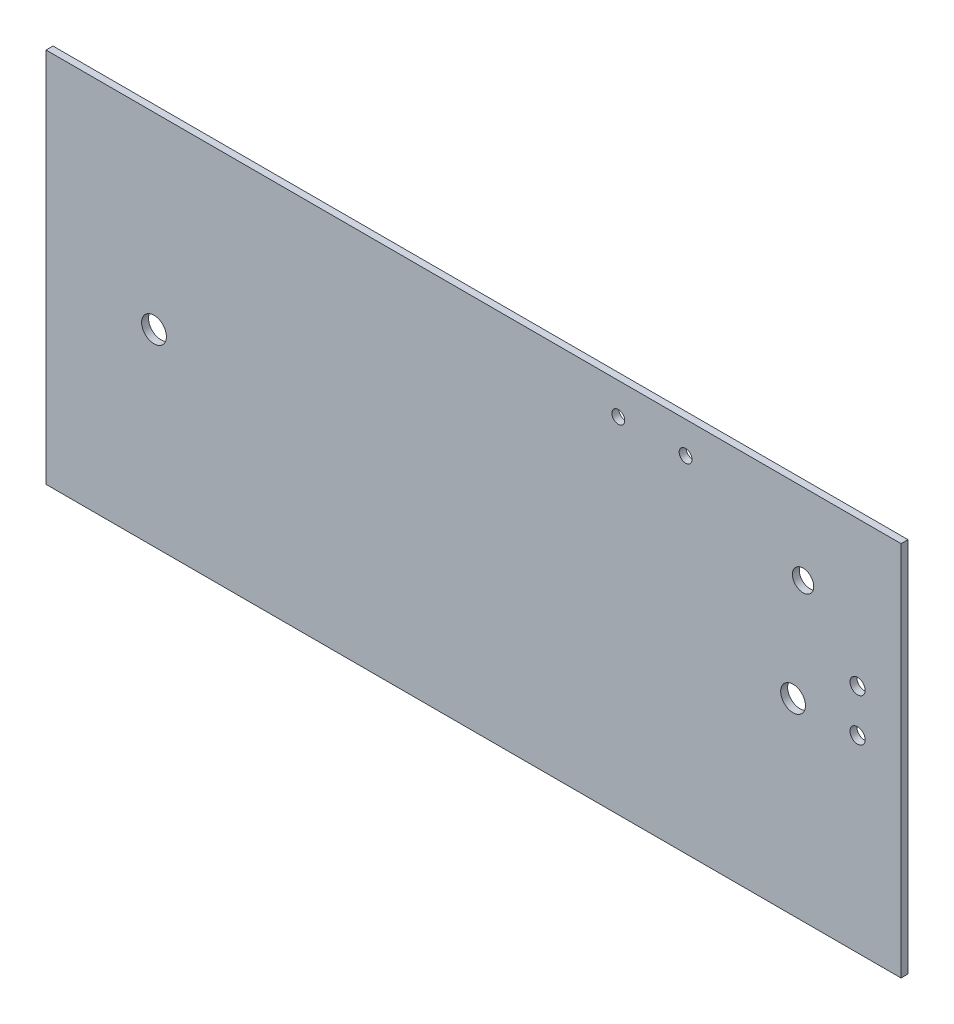
ISO-10303-21;
HEADER;
FILE_DESCRIPTION(('STEP AP214'),'2;1');
FILE_NAME('part.step','',(''),(''),'','','');
FILE_SCHEMA(('AUTOMOTIVE_DESIGN { 1 0 10303 214 1 1 1 1 }'));
ENDSEC;
DATA;
#1=APPLICATION_CONTEXT('core data for automotive mechanical design processes');
#2=APPLICATION_PROTOCOL_DEFINITION('international standard','automotive_design',2000,#1);
#3=PRODUCT_CONTEXT('',#1,'mechanical');
#4=PRODUCT('Part','Part','',(#3));
#5=PRODUCT_RELATED_PRODUCT_CATEGORY('part','',(#4));
#6=PRODUCT_DEFINITION_FORMATION('','',#4);
#7=PRODUCT_DEFINITION_CONTEXT('part definition',#1,'design');
#8=PRODUCT_DEFINITION('design','',#6,#7);
#9=PRODUCT_DEFINITION_SHAPE('','',#8);
#10=(LENGTH_UNIT() NAMED_UNIT(*) SI_UNIT(.MILLI.,.METRE.));
#11=(NAMED_UNIT(*) PLANE_ANGLE_UNIT() SI_UNIT($,.RADIAN.));
#12=(NAMED_UNIT(*) SI_UNIT($,.STERADIAN.) SOLID_ANGLE_UNIT());
#13=UNCERTAINTY_MEASURE_WITH_UNIT(LENGTH_MEASURE(1.E-05),#10,'distance_accuracy_value','');
#14=(GEOMETRIC_REPRESENTATION_CONTEXT(3) GLOBAL_UNCERTAINTY_ASSIGNED_CONTEXT((#13)) GLOBAL_UNIT_ASSIGNED_CONTEXT((#10,
#11,#12)) REPRESENTATION_CONTEXT('',''));
#15=CARTESIAN_POINT('',(0.,0.,0.));
#16=DIRECTION('',(0.,0.,1.));
#17=DIRECTION('',(1.,0.,0.));
#18=AXIS2_PLACEMENT_3D('',#15,#16,#17);
#19=CARTESIAN_POINT('',(0.,0.,0.41148));
#20=DIRECTION('',(0.,0.,-1.));
#21=DIRECTION('',(-1.,0.,0.));
#22=AXIS2_PLACEMENT_3D('',#19,#20,#21);
#23=PLANE('',#22);
#24=CARTESIAN_POINT('',(48.21790204,13.7309987,0.41148));
#25=DIRECTION('',(0.,0.,-1.));
#26=DIRECTION('',(-1.,0.,0.));
#27=AXIS2_PLACEMENT_3D('',#24,#25,#26);
#28=CIRCLE('',#27,0.4499991);
#29=CARTESIAN_POINT('',(47.76790294,13.7309987,0.41148));
#30=VERTEX_POINT('',#29);
#31=EDGE_CURVE('E100',#30,#30,#28,.T.);
#32=ORIENTED_EDGE('',*,*,#31,.T.);
#33=EDGE_LOOP('',(#32));
#34=FACE_BOUND('',#33,.T.);
#35=CARTESIAN_POINT('',(44.98000148,17.54599996,0.41148));
#36=DIRECTION('',(0.,0.,-1.));
#37=DIRECTION('',(-1.,0.,0.));
#38=AXIS2_PLACEMENT_3D('',#35,#36,#37);
#39=CIRCLE('',#38,0.635);
#40=CARTESIAN_POINT('',(44.34500148,17.54599996,0.41148));
#41=VERTEX_POINT('',#40);
#42=EDGE_CURVE('E104',#41,#41,#39,.T.);
#43=ORIENTED_EDGE('',*,*,#42,.T.);
#44=EDGE_LOOP('',(#43));
#45=FACE_BOUND('',#44,.T.);
#46=CARTESIAN_POINT('',(48.21790204,11.1909987,0.41148));
#47=DIRECTION('',(0.,0.,-1.));
#48=DIRECTION('',(-1.,0.,0.));
#49=AXIS2_PLACEMENT_3D('',#46,#47,#48);
#50=CIRCLE('',#49,0.4499991);
#51=CARTESIAN_POINT('',(47.76790294,11.1909987,0.41148));
#52=VERTEX_POINT('',#51);
#53=EDGE_CURVE('E107',#52,#52,#50,.T.);
#54=ORIENTED_EDGE('',*,*,#53,.T.);
#55=EDGE_LOOP('',(#54));
#56=FACE_BOUND('',#55,.T.);
#57=CARTESIAN_POINT('',(44.3850014,11.176,0.41148));
#58=DIRECTION('',(0.,0.,-1.));
#59=DIRECTION('',(-1.,0.,0.));
#60=AXIS2_PLACEMENT_3D('',#57,#58,#59);
#61=CIRCLE('',#60,0.7349998);
#62=CARTESIAN_POINT('',(43.6500016,11.176,0.41148));
#63=VERTEX_POINT('',#62);
#64=EDGE_CURVE('E110',#63,#63,#61,.T.);
#65=ORIENTED_EDGE('',*,*,#64,.T.);
#66=EDGE_LOOP('',(#65));
#67=FACE_BOUND('',#66,.T.);
#68=CARTESIAN_POINT('',(38.0000002,20.4724,0.41148));
#69=DIRECTION('',(0.,0.,-1.));
#70=DIRECTION('',(-1.,0.,0.));
#71=AXIS2_PLACEMENT_3D('',#68,#69,#70);
#72=CIRCLE('',#71,0.381);
#73=CARTESIAN_POINT('',(37.6190002,20.4724,0.41148));
#74=VERTEX_POINT('',#73);
#75=EDGE_CURVE('E113',#74,#74,#72,.T.);
#76=ORIENTED_EDGE('',*,*,#75,.T.);
#77=EDGE_LOOP('',(#76));
#78=FACE_BOUND('',#77,.T.);
#79=CARTESIAN_POINT('',(34.00000058,20.4724,0.41148));
#80=DIRECTION('',(0.,0.,-1.));
#81=DIRECTION('',(-1.,0.,0.));
#82=AXIS2_PLACEMENT_3D('',#79,#80,#81);
#83=CIRCLE('',#82,0.381);
#84=CARTESIAN_POINT('',(33.61900058,20.4724,0.41148));
#85=VERTEX_POINT('',#84);
#86=EDGE_CURVE('E115',#85,#85,#83,.T.);
#87=ORIENTED_EDGE('',*,*,#86,.T.);
#88=EDGE_LOOP('',(#87));
#89=FACE_BOUND('',#88,.T.);
#90=CARTESIAN_POINT('',(6.41500114,11.176,0.41148));
#91=DIRECTION('',(0.,0.,-1.));
#92=DIRECTION('',(-1.,0.,0.));
#93=AXIS2_PLACEMENT_3D('',#90,#91,#92);
#94=CIRCLE('',#93,0.7349998);
#95=CARTESIAN_POINT('',(5.68000134,11.176,0.41148));
#96=VERTEX_POINT('',#95);
#97=EDGE_CURVE('E20',#96,#96,#94,.T.);
#98=ORIENTED_EDGE('',*,*,#97,.T.);
#99=EDGE_LOOP('',(#98));
#100=FACE_BOUND('',#99,.T.);
#101=DIRECTION('',(0.,1.,0.));
#102=VECTOR('',#101,1.);
#103=CARTESIAN_POINT('',(50.8,0.,0.41148));
#104=LINE('',#103,#102);
#105=CARTESIAN_POINT('',(50.8,0.,0.41148));
#106=VERTEX_POINT('',#105);
#107=CARTESIAN_POINT('',(50.8,22.352,0.41148));
#108=VERTEX_POINT('',#107);
#109=EDGE_CURVE('E55',#106,#108,#104,.T.);
#110=ORIENTED_EDGE('',*,*,#109,.T.);
#111=DIRECTION('',(1.,0.,0.));
#112=VECTOR('',#111,1.);
#113=CARTESIAN_POINT('',(50.8,22.352,0.41148));
#114=LINE('',#113,#112);
#115=CARTESIAN_POINT('',(0.,22.352,0.41148));
#116=VERTEX_POINT('',#115);
#117=EDGE_CURVE('E57',#108,#116,#114,.F.);
#118=ORIENTED_EDGE('',*,*,#117,.T.);
#119=DIRECTION('',(0.,1.,0.));
#120=VECTOR('',#119,1.);
#121=CARTESIAN_POINT('',(0.,22.352,0.41148));
#122=LINE('',#121,#120);
#123=CARTESIAN_POINT('',(0.,0.,0.41148));
#124=VERTEX_POINT('',#123);
#125=EDGE_CURVE('E59',#116,#124,#122,.F.);
#126=ORIENTED_EDGE('',*,*,#125,.T.);
#127=DIRECTION('',(1.,0.,0.));
#128=VECTOR('',#127,1.);
#129=CARTESIAN_POINT('',(0.,0.,0.41148));
#130=LINE('',#129,#128);
#131=EDGE_CURVE('E122',#124,#106,#130,.T.);
#132=ORIENTED_EDGE('',*,*,#131,.T.);
#133=EDGE_LOOP('',(#110,#118,#126,#132));
#134=FACE_BOUND('',#133,.T.);
#135=ADVANCED_FACE('F17',(#34,#45,#56,#67,#78,#89,#100,#134),#23,.F.);
#136=CARTESIAN_POINT('',(0.,22.352,0.));
#137=DIRECTION('',(1.,0.,0.));
#138=DIRECTION('',(0.,0.,-1.));
#139=AXIS2_PLACEMENT_3D('',#136,#137,#138);
#140=PLANE('',#139);
#141=DIRECTION('',(0.,0.,1.));
#142=VECTOR('',#141,1.);
#143=CARTESIAN_POINT('',(0.,0.,0.));
#144=LINE('',#143,#142);
#145=CARTESIAN_POINT('',(0.,0.,0.));
#146=VERTEX_POINT('',#145);
#147=EDGE_CURVE('E70',#146,#124,#144,.T.);
#148=ORIENTED_EDGE('',*,*,#147,.T.);
#149=ORIENTED_EDGE('',*,*,#125,.F.);
#150=DIRECTION('',(0.,0.,-1.));
#151=VECTOR('',#150,1.);
#152=CARTESIAN_POINT('',(0.,22.352,0.));
#153=LINE('',#152,#151);
#154=CARTESIAN_POINT('',(0.,22.352,0.));
#155=VERTEX_POINT('',#154);
#156=EDGE_CURVE('E64',#116,#155,#153,.T.);
#157=ORIENTED_EDGE('',*,*,#156,.T.);
#158=DIRECTION('',(0.,1.,0.));
#159=VECTOR('',#158,1.);
#160=CARTESIAN_POINT('',(0.,0.,0.));
#161=LINE('',#160,#159);
#162=EDGE_CURVE('E103',#146,#155,#161,.T.);
#163=ORIENTED_EDGE('',*,*,#162,.F.);
#164=EDGE_LOOP('',(#148,#149,#157,#163));
#165=FACE_BOUND('',#164,.T.);
#166=ADVANCED_FACE('F67',(#165),#140,.F.);
#167=CARTESIAN_POINT('',(50.8,22.352,0.));
#168=DIRECTION('',(0.,-1.,0.));
#169=DIRECTION('',(0.,0.,-1.));
#170=AXIS2_PLACEMENT_3D('',#167,#168,#169);
#171=PLANE('',#170);
#172=ORIENTED_EDGE('',*,*,#156,.F.);
#173=ORIENTED_EDGE('',*,*,#117,.F.);
#174=DIRECTION('',(0.,0.,1.));
#175=VECTOR('',#174,1.);
#176=CARTESIAN_POINT('',(50.8,22.352,0.));
#177=LINE('',#176,#175);
#178=CARTESIAN_POINT('',(50.8,22.352,0.));
#179=VERTEX_POINT('',#178);
#180=EDGE_CURVE('E78',#108,#179,#177,.F.);
#181=ORIENTED_EDGE('',*,*,#180,.T.);
#182=DIRECTION('',(-1.,0.,0.));
#183=VECTOR('',#182,1.);
#184=CARTESIAN_POINT('',(0.,22.352,0.));
#185=LINE('',#184,#183);
#186=EDGE_CURVE('E75',#155,#179,#185,.F.);
#187=ORIENTED_EDGE('',*,*,#186,.F.);
#188=EDGE_LOOP('',(#172,#173,#181,#187));
#189=FACE_BOUND('',#188,.T.);
#190=ADVANCED_FACE('F73',(#189),#171,.F.);
#191=CARTESIAN_POINT('',(50.8,0.,0.));
#192=DIRECTION('',(-1.,0.,0.));
#193=DIRECTION('',(0.,0.,1.));
#194=AXIS2_PLACEMENT_3D('',#191,#192,#193);
#195=PLANE('',#194);
#196=ORIENTED_EDGE('',*,*,#180,.F.);
#197=ORIENTED_EDGE('',*,*,#109,.F.);
#198=DIRECTION('',(0.,0.,1.));
#199=VECTOR('',#198,1.);
#200=CARTESIAN_POINT('',(50.8,0.,0.));
#201=LINE('',#200,#199);
#202=CARTESIAN_POINT('',(50.8,0.,0.));
#203=VERTEX_POINT('',#202);
#204=EDGE_CURVE('E35',#106,#203,#201,.F.);
#205=ORIENTED_EDGE('',*,*,#204,.T.);
#206=DIRECTION('',(0.,1.,0.));
#207=VECTOR('',#206,1.);
#208=CARTESIAN_POINT('',(50.8,0.,0.));
#209=LINE('',#208,#207);
#210=EDGE_CURVE('E129',#179,#203,#209,.F.);
#211=ORIENTED_EDGE('',*,*,#210,.F.);
#212=EDGE_LOOP('',(#196,#197,#205,#211));
#213=FACE_BOUND('',#212,.T.);
#214=ADVANCED_FACE('F130',(#213),#195,.F.);
#215=CARTESIAN_POINT('',(0.,0.,0.));
#216=DIRECTION('',(0.,1.,0.));
#217=DIRECTION('',(0.,0.,1.));
#218=AXIS2_PLACEMENT_3D('',#215,#216,#217);
#219=PLANE('',#218);
#220=ORIENTED_EDGE('',*,*,#204,.F.);
#221=ORIENTED_EDGE('',*,*,#131,.F.);
#222=ORIENTED_EDGE('',*,*,#147,.F.);
#223=DIRECTION('',(-1.,0.,0.));
#224=VECTOR('',#223,1.);
#225=CARTESIAN_POINT('',(0.,0.,0.));
#226=LINE('',#225,#224);
#227=EDGE_CURVE('E99',#203,#146,#226,.T.);
#228=ORIENTED_EDGE('',*,*,#227,.F.);
#229=EDGE_LOOP('',(#220,#221,#222,#228));
#230=FACE_BOUND('',#229,.T.);
#231=ADVANCED_FACE('F137',(#230),#219,.F.);
#232=CARTESIAN_POINT('',(6.41500114,11.176,0.));
#233=DIRECTION('',(0.,0.,-1.));
#234=DIRECTION('',(-1.,0.,0.));
#235=AXIS2_PLACEMENT_3D('',#232,#233,#234);
#236=CYLINDRICAL_SURFACE('',#235,0.7349998);
#237=ORIENTED_EDGE('',*,*,#97,.F.);
#238=EDGE_LOOP('',(#237));
#239=FACE_BOUND('',#238,.T.);
#240=CARTESIAN_POINT('',(6.41500114,11.176,0.));
#241=DIRECTION('',(0.,0.,-1.));
#242=DIRECTION('',(-1.,0.,0.));
#243=AXIS2_PLACEMENT_3D('',#240,#241,#242);
#244=CIRCLE('',#243,0.7349998);
#245=CARTESIAN_POINT('',(5.68000134,11.176,0.));
#246=VERTEX_POINT('',#245);
#247=EDGE_CURVE('E96',#246,#246,#244,.F.);
#248=ORIENTED_EDGE('',*,*,#247,.F.);
#249=EDGE_LOOP('',(#248));
#250=FACE_BOUND('',#249,.T.);
#251=ADVANCED_FACE('F139',(#239,#250),#236,.F.);
#252=CARTESIAN_POINT('',(34.00000058,20.4724,0.));
#253=DIRECTION('',(0.,0.,-1.));
#254=DIRECTION('',(-1.,0.,0.));
#255=AXIS2_PLACEMENT_3D('',#252,#253,#254);
#256=CYLINDRICAL_SURFACE('',#255,0.381);
#257=ORIENTED_EDGE('',*,*,#86,.F.);
#258=EDGE_LOOP('',(#257));
#259=FACE_BOUND('',#258,.T.);
#260=CARTESIAN_POINT('',(34.00000058,20.4724,0.));
#261=DIRECTION('',(0.,0.,-1.));
#262=DIRECTION('',(-1.,0.,0.));
#263=AXIS2_PLACEMENT_3D('',#260,#261,#262);
#264=CIRCLE('',#263,0.381);
#265=CARTESIAN_POINT('',(33.61900058,20.4724,0.));
#266=VERTEX_POINT('',#265);
#267=EDGE_CURVE('E93',#266,#266,#264,.F.);
#268=ORIENTED_EDGE('',*,*,#267,.F.);
#269=EDGE_LOOP('',(#268));
#270=FACE_BOUND('',#269,.T.);
#271=ADVANCED_FACE('F146',(#259,#270),#256,.F.);
#272=CARTESIAN_POINT('',(38.0000002,20.4724,0.));
#273=DIRECTION('',(0.,0.,-1.));
#274=DIRECTION('',(-1.,0.,0.));
#275=AXIS2_PLACEMENT_3D('',#272,#273,#274);
#276=CYLINDRICAL_SURFACE('',#275,0.381);
#277=ORIENTED_EDGE('',*,*,#75,.F.);
#278=EDGE_LOOP('',(#277));
#279=FACE_BOUND('',#278,.T.);
#280=CARTESIAN_POINT('',(38.0000002,20.4724,0.));
#281=DIRECTION('',(0.,0.,-1.));
#282=DIRECTION('',(-1.,0.,0.));
#283=AXIS2_PLACEMENT_3D('',#280,#281,#282);
#284=CIRCLE('',#283,0.381);
#285=CARTESIAN_POINT('',(37.6190002,20.4724,0.));
#286=VERTEX_POINT('',#285);
#287=EDGE_CURVE('E90',#286,#286,#284,.F.);
#288=ORIENTED_EDGE('',*,*,#287,.F.);
#289=EDGE_LOOP('',(#288));
#290=FACE_BOUND('',#289,.T.);
#291=ADVANCED_FACE('F172',(#279,#290),#276,.F.);
#292=CARTESIAN_POINT('',(44.3850014,11.176,0.));
#293=DIRECTION('',(0.,0.,-1.));
#294=DIRECTION('',(-1.,0.,0.));
#295=AXIS2_PLACEMENT_3D('',#292,#293,#294);
#296=CYLINDRICAL_SURFACE('',#295,0.7349998);
#297=ORIENTED_EDGE('',*,*,#64,.F.);
#298=EDGE_LOOP('',(#297));
#299=FACE_BOUND('',#298,.T.);
#300=CARTESIAN_POINT('',(44.3850014,11.176,0.));
#301=DIRECTION('',(0.,0.,-1.));
#302=DIRECTION('',(-1.,0.,0.));
#303=AXIS2_PLACEMENT_3D('',#300,#301,#302);
#304=CIRCLE('',#303,0.7349998);
#305=CARTESIAN_POINT('',(43.6500016,11.176,0.));
#306=VERTEX_POINT('',#305);
#307=EDGE_CURVE('E87',#306,#306,#304,.F.);
#308=ORIENTED_EDGE('',*,*,#307,.F.);
#309=EDGE_LOOP('',(#308));
#310=FACE_BOUND('',#309,.T.);
#311=ADVANCED_FACE('F168',(#299,#310),#296,.F.);
#312=CARTESIAN_POINT('',(48.21790204,11.1909987,0.));
#313=DIRECTION('',(0.,0.,-1.));
#314=DIRECTION('',(-1.,0.,0.));
#315=AXIS2_PLACEMENT_3D('',#312,#313,#314);
#316=CYLINDRICAL_SURFACE('',#315,0.4499991);
#317=ORIENTED_EDGE('',*,*,#53,.F.);
#318=EDGE_LOOP('',(#317));
#319=FACE_BOUND('',#318,.T.);
#320=CARTESIAN_POINT('',(48.21790204,11.1909987,0.));
#321=DIRECTION('',(0.,0.,-1.));
#322=DIRECTION('',(-1.,0.,0.));
#323=AXIS2_PLACEMENT_3D('',#320,#321,#322);
#324=CIRCLE('',#323,0.4499991);
#325=CARTESIAN_POINT('',(47.76790294,11.1909987,0.));
#326=VERTEX_POINT('',#325);
#327=EDGE_CURVE('E84',#326,#326,#324,.F.);
#328=ORIENTED_EDGE('',*,*,#327,.F.);
#329=EDGE_LOOP('',(#328));
#330=FACE_BOUND('',#329,.T.);
#331=ADVANCED_FACE('F164',(#319,#330),#316,.F.);
#332=CARTESIAN_POINT('',(44.98000148,17.54599996,0.));
#333=DIRECTION('',(0.,0.,-1.));
#334=DIRECTION('',(-1.,0.,0.));
#335=AXIS2_PLACEMENT_3D('',#332,#333,#334);
#336=CYLINDRICAL_SURFACE('',#335,0.635);
#337=ORIENTED_EDGE('',*,*,#42,.F.);
#338=EDGE_LOOP('',(#337));
#339=FACE_BOUND('',#338,.T.);
#340=CARTESIAN_POINT('',(44.98000148,17.54599996,0.));
#341=DIRECTION('',(0.,0.,-1.));
#342=DIRECTION('',(-1.,0.,0.));
#343=AXIS2_PLACEMENT_3D('',#340,#341,#342);
#344=CIRCLE('',#343,0.635);
#345=CARTESIAN_POINT('',(44.34500148,17.54599996,0.));
#346=VERTEX_POINT('',#345);
#347=EDGE_CURVE('E26',#346,#346,#344,.F.);
#348=ORIENTED_EDGE('',*,*,#347,.F.);
#349=EDGE_LOOP('',(#348));
#350=FACE_BOUND('',#349,.T.);
#351=ADVANCED_FACE('F157',(#339,#350),#336,.F.);
#352=CARTESIAN_POINT('',(48.21790204,13.7309987,0.));
#353=DIRECTION('',(0.,0.,-1.));
#354=DIRECTION('',(-1.,0.,0.));
#355=AXIS2_PLACEMENT_3D('',#352,#353,#354);
#356=CYLINDRICAL_SURFACE('',#355,0.4499991);
#357=ORIENTED_EDGE('',*,*,#31,.F.);
#358=EDGE_LOOP('',(#357));
#359=FACE_BOUND('',#358,.T.);
#360=CARTESIAN_POINT('',(48.21790204,13.7309987,0.));
#361=DIRECTION('',(0.,0.,-1.));
#362=DIRECTION('',(-1.,0.,0.));
#363=AXIS2_PLACEMENT_3D('',#360,#361,#362);
#364=CIRCLE('',#363,0.4499991);
#365=CARTESIAN_POINT('',(47.76790294,13.7309987,0.));
#366=VERTEX_POINT('',#365);
#367=EDGE_CURVE('E11',#366,#366,#364,.F.);
#368=ORIENTED_EDGE('',*,*,#367,.F.);
#369=EDGE_LOOP('',(#368));
#370=FACE_BOUND('',#369,.T.);
#371=ADVANCED_FACE('F151',(#359,#370),#356,.F.);
#372=CARTESIAN_POINT('',(0.,0.,0.));
#373=DIRECTION('',(0.,0.,-1.));
#374=DIRECTION('',(-1.,0.,0.));
#375=AXIS2_PLACEMENT_3D('',#372,#373,#374);
#376=PLANE('',#375);
#377=ORIENTED_EDGE('',*,*,#367,.T.);
#378=EDGE_LOOP('',(#377));
#379=FACE_BOUND('',#378,.T.);
#380=ORIENTED_EDGE('',*,*,#347,.T.);
#381=EDGE_LOOP('',(#380));
#382=FACE_BOUND('',#381,.T.);
#383=ORIENTED_EDGE('',*,*,#327,.T.);
#384=EDGE_LOOP('',(#383));
#385=FACE_BOUND('',#384,.T.);
#386=ORIENTED_EDGE('',*,*,#307,.T.);
#387=EDGE_LOOP('',(#386));
#388=FACE_BOUND('',#387,.T.);
#389=ORIENTED_EDGE('',*,*,#287,.T.);
#390=EDGE_LOOP('',(#389));
#391=FACE_BOUND('',#390,.T.);
#392=ORIENTED_EDGE('',*,*,#267,.T.);
#393=EDGE_LOOP('',(#392));
#394=FACE_BOUND('',#393,.T.);
#395=ORIENTED_EDGE('',*,*,#247,.T.);
#396=EDGE_LOOP('',(#395));
#397=FACE_BOUND('',#396,.T.);
#398=ORIENTED_EDGE('',*,*,#210,.T.);
#399=ORIENTED_EDGE('',*,*,#227,.T.);
#400=ORIENTED_EDGE('',*,*,#162,.T.);
#401=ORIENTED_EDGE('',*,*,#186,.T.);
#402=EDGE_LOOP('',(#398,#399,#400,#401));
#403=FACE_BOUND('',#402,.T.);
#404=ADVANCED_FACE('F134',(#379,#382,#385,#388,#391,#394,#397,#403),#376,.T.);
#405=CLOSED_SHELL('',(#135,#166,#190,#214,#231,#251,#271,#291,#311,#331,#351,#371,#404));
#406=MANIFOLD_SOLID_BREP('B1',#405);
#407=ADVANCED_BREP_SHAPE_REPRESENTATION('',(#18,#406),#14);
#408=SHAPE_DEFINITION_REPRESENTATION(#9,#407);
ENDSEC;
END-ISO-10303-21;
